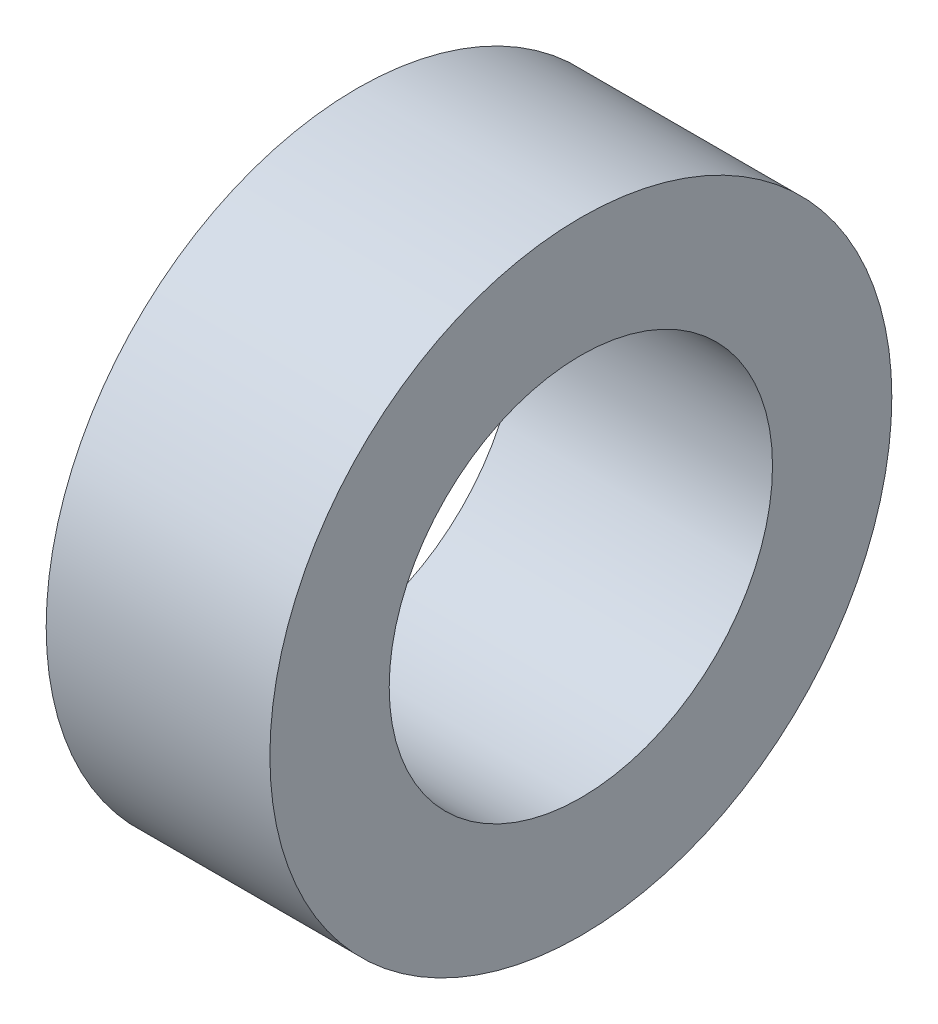
ISO-10303-21;
HEADER;
FILE_DESCRIPTION(('STEP AP214'),'2;1');
FILE_NAME('part.step','',(''),(''),'','','');
FILE_SCHEMA(('AUTOMOTIVE_DESIGN { 1 0 10303 214 1 1 1 1 }'));
ENDSEC;
DATA;
#1=APPLICATION_CONTEXT('core data for automotive mechanical design processes');
#2=APPLICATION_PROTOCOL_DEFINITION('international standard','automotive_design',2000,#1);
#3=PRODUCT_CONTEXT('',#1,'mechanical');
#4=PRODUCT('Part','Part','',(#3));
#5=PRODUCT_RELATED_PRODUCT_CATEGORY('part','',(#4));
#6=PRODUCT_DEFINITION_FORMATION('','',#4);
#7=PRODUCT_DEFINITION_CONTEXT('part definition',#1,'design');
#8=PRODUCT_DEFINITION('design','',#6,#7);
#9=PRODUCT_DEFINITION_SHAPE('','',#8);
#10=(LENGTH_UNIT() NAMED_UNIT(*) SI_UNIT(.MILLI.,.METRE.));
#11=(NAMED_UNIT(*) PLANE_ANGLE_UNIT() SI_UNIT($,.RADIAN.));
#12=(NAMED_UNIT(*) SI_UNIT($,.STERADIAN.) SOLID_ANGLE_UNIT());
#13=UNCERTAINTY_MEASURE_WITH_UNIT(LENGTH_MEASURE(1.E-05),#10,'distance_accuracy_value','');
#14=(GEOMETRIC_REPRESENTATION_CONTEXT(3) GLOBAL_UNCERTAINTY_ASSIGNED_CONTEXT((#13)) GLOBAL_UNIT_ASSIGNED_CONTEXT((#10,
#11,#12)) REPRESENTATION_CONTEXT('',''));
#15=CARTESIAN_POINT('',(0.,0.,0.));
#16=DIRECTION('',(0.,0.,1.));
#17=DIRECTION('',(1.,0.,0.));
#18=AXIS2_PLACEMENT_3D('',#15,#16,#17);
#19=CARTESIAN_POINT('',(13.550000078,0.,0.));
#20=DIRECTION('',(-1.,0.,0.));
#21=DIRECTION('',(0.,0.,1.));
#22=AXIS2_PLACEMENT_3D('',#19,#20,#21);
#23=CYLINDRICAL_SURFACE('',#22,11.901099896);
#24=CARTESIAN_POINT('',(0.,0.,0.));
#25=DIRECTION('',(1.,0.,0.));
#26=DIRECTION('',(0.,0.,-1.));
#27=AXIS2_PLACEMENT_3D('',#24,#25,#26);
#28=CIRCLE('',#27,11.901099896);
#29=CARTESIAN_POINT('',(0.,0.,-11.901099896));
#30=VERTEX_POINT('',#29);
#31=EDGE_CURVE('E35',#30,#30,#28,.T.);
#32=ORIENTED_EDGE('',*,*,#31,.T.);
#33=EDGE_LOOP('',(#32));
#34=FACE_BOUND('',#33,.T.);
#35=CARTESIAN_POINT('',(1.643750078,0.,0.));
#36=DIRECTION('',(1.,0.,0.));
#37=DIRECTION('',(0.,0.,-1.));
#38=AXIS2_PLACEMENT_3D('',#35,#36,#37);
#39=CIRCLE('',#38,11.901099896);
#40=CARTESIAN_POINT('',(1.643750078,0.,-11.901099896));
#41=VERTEX_POINT('',#40);
#42=EDGE_CURVE('E10',#41,#41,#39,.T.);
#43=ORIENTED_EDGE('',*,*,#42,.F.);
#44=EDGE_LOOP('',(#43));
#45=FACE_BOUND('',#44,.T.);
#46=ADVANCED_FACE('F32',(#34,#45),#23,.T.);
#47=CARTESIAN_POINT('',(13.550000078,0.,0.));
#48=DIRECTION('',(1.,0.,0.));
#49=DIRECTION('',(0.,0.,-1.));
#50=AXIS2_PLACEMENT_3D('',#47,#48,#49);
#51=PLANE('',#50);
#52=CARTESIAN_POINT('',(13.550000078,0.,0.));
#53=DIRECTION('',(1.,0.,0.));
#54=DIRECTION('',(0.,0.,-1.));
#55=AXIS2_PLACEMENT_3D('',#52,#53,#54);
#56=CIRCLE('',#55,10.2);
#57=CARTESIAN_POINT('',(13.550000078,0.,-10.2));
#58=VERTEX_POINT('',#57);
#59=EDGE_CURVE('E43',#58,#58,#56,.T.);
#60=ORIENTED_EDGE('',*,*,#59,.F.);
#61=EDGE_LOOP('',(#60));
#62=FACE_BOUND('',#61,.T.);
#63=CARTESIAN_POINT('',(13.550000078,0.,0.));
#64=DIRECTION('',(1.,0.,0.));
#65=DIRECTION('',(0.,0.,-1.));
#66=AXIS2_PLACEMENT_3D('',#63,#64,#65);
#67=CIRCLE('',#66,16.55);
#68=CARTESIAN_POINT('',(13.550000078,0.,-16.55));
#69=VERTEX_POINT('',#68);
#70=EDGE_CURVE('E46',#69,#69,#67,.T.);
#71=ORIENTED_EDGE('',*,*,#70,.T.);
#72=EDGE_LOOP('',(#71));
#73=FACE_BOUND('',#72,.T.);
#74=ADVANCED_FACE('F60',(#62,#73),#51,.T.);
#75=CARTESIAN_POINT('',(0.,0.,0.));
#76=DIRECTION('',(1.,0.,0.));
#77=DIRECTION('',(0.,0.,-1.));
#78=AXIS2_PLACEMENT_3D('',#75,#76,#77);
#79=PLANE('',#78);
#80=ORIENTED_EDGE('',*,*,#31,.F.);
#81=EDGE_LOOP('',(#80));
#82=FACE_BOUND('',#81,.T.);
#83=CARTESIAN_POINT('',(0.,0.,0.));
#84=DIRECTION('',(1.,0.,0.));
#85=DIRECTION('',(0.,0.,-1.));
#86=AXIS2_PLACEMENT_3D('',#83,#84,#85);
#87=CIRCLE('',#86,10.2);
#88=CARTESIAN_POINT('',(0.,0.,-10.2));
#89=VERTEX_POINT('',#88);
#90=EDGE_CURVE('E49',#89,#89,#87,.T.);
#91=ORIENTED_EDGE('',*,*,#90,.T.);
#92=EDGE_LOOP('',(#91));
#93=FACE_BOUND('',#92,.T.);
#94=ADVANCED_FACE('F78',(#82,#93),#79,.F.);
#95=CARTESIAN_POINT('',(13.550000078,0.,0.));
#96=DIRECTION('',(-1.,0.,0.));
#97=DIRECTION('',(0.,0.,1.));
#98=AXIS2_PLACEMENT_3D('',#95,#96,#97);
#99=CYLINDRICAL_SURFACE('',#98,10.2);
#100=ORIENTED_EDGE('',*,*,#59,.T.);
#101=EDGE_LOOP('',(#100));
#102=FACE_BOUND('',#101,.T.);
#103=ORIENTED_EDGE('',*,*,#90,.F.);
#104=EDGE_LOOP('',(#103));
#105=FACE_BOUND('',#104,.T.);
#106=ADVANCED_FACE('F69',(#102,#105),#99,.F.);
#107=CARTESIAN_POINT('',(1.643750078,0.,0.));
#108=DIRECTION('',(1.,0.,0.));
#109=DIRECTION('',(0.,0.,-1.));
#110=AXIS2_PLACEMENT_3D('',#107,#108,#109);
#111=PLANE('',#110);
#112=CARTESIAN_POINT('',(1.643750078,0.,0.));
#113=DIRECTION('',(1.,0.,0.));
#114=DIRECTION('',(0.,0.,-1.));
#115=AXIS2_PLACEMENT_3D('',#112,#113,#114);
#116=CIRCLE('',#115,16.55);
#117=CARTESIAN_POINT('',(1.643750078,0.,-16.55));
#118=VERTEX_POINT('',#117);
#119=EDGE_CURVE('E51',#118,#118,#116,.T.);
#120=ORIENTED_EDGE('',*,*,#119,.F.);
#121=EDGE_LOOP('',(#120));
#122=FACE_BOUND('',#121,.T.);
#123=ORIENTED_EDGE('',*,*,#42,.T.);
#124=EDGE_LOOP('',(#123));
#125=FACE_BOUND('',#124,.T.);
#126=ADVANCED_FACE('F64',(#122,#125),#111,.F.);
#127=CARTESIAN_POINT('',(1.643750078,0.,0.));
#128=DIRECTION('',(1.,0.,0.));
#129=DIRECTION('',(0.,0.,-1.));
#130=AXIS2_PLACEMENT_3D('',#127,#128,#129);
#131=CYLINDRICAL_SURFACE('',#130,16.55);
#132=ORIENTED_EDGE('',*,*,#119,.T.);
#133=EDGE_LOOP('',(#132));
#134=FACE_BOUND('',#133,.T.);
#135=ORIENTED_EDGE('',*,*,#70,.F.);
#136=EDGE_LOOP('',(#135));
#137=FACE_BOUND('',#136,.T.);
#138=ADVANCED_FACE('F62',(#134,#137),#131,.T.);
#139=CLOSED_SHELL('',(#46,#74,#94,#106,#126,#138));
#140=MANIFOLD_SOLID_BREP('B2',#139);
#141=ADVANCED_BREP_SHAPE_REPRESENTATION('',(#18,#140),#14);
#142=SHAPE_DEFINITION_REPRESENTATION(#9,#141);
ENDSEC;
END-ISO-10303-21;
